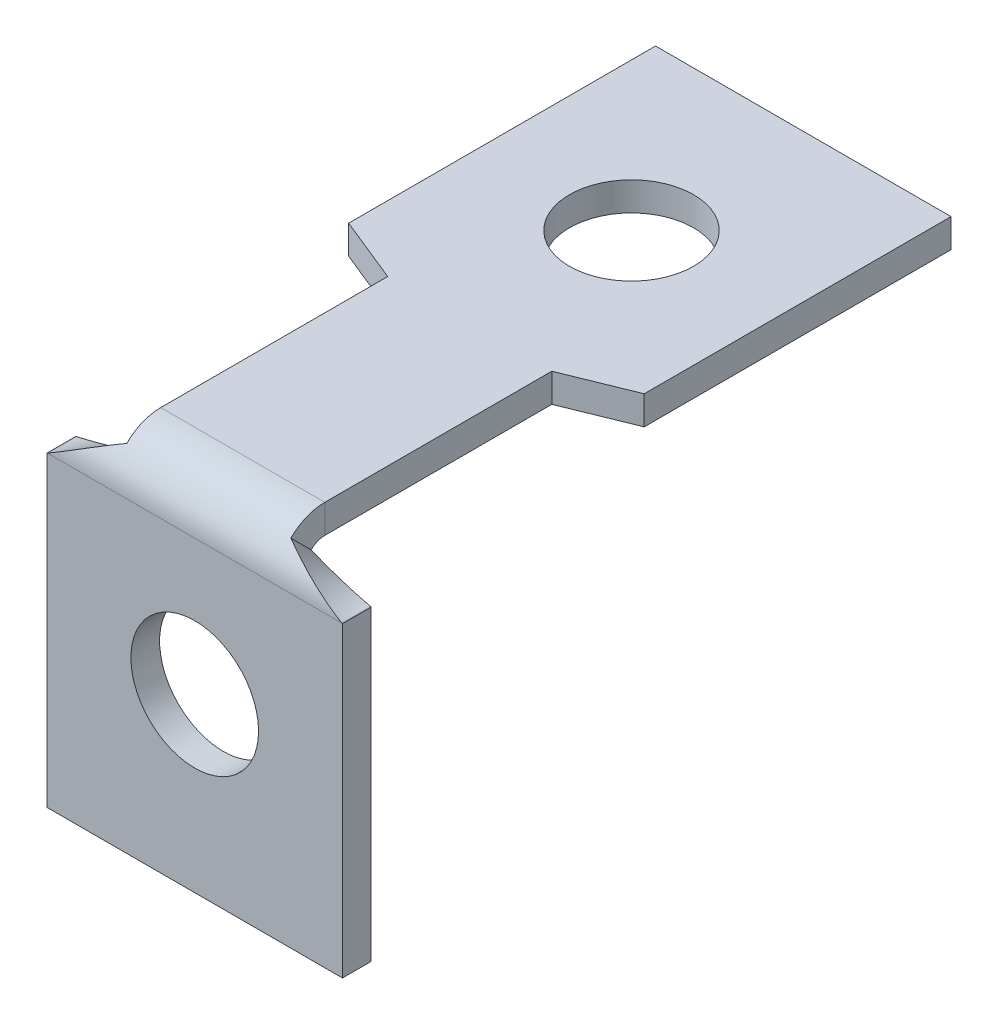
ISO-10303-21;
HEADER;
FILE_DESCRIPTION(('STEP AP214'),'2;1');
FILE_NAME('part.step','',(''),(''),'','','');
FILE_SCHEMA(('AUTOMOTIVE_DESIGN { 1 0 10303 214 1 1 1 1 }'));
ENDSEC;
DATA;
#1=APPLICATION_CONTEXT('core data for automotive mechanical design processes');
#2=APPLICATION_PROTOCOL_DEFINITION('international standard','automotive_design',2000,#1);
#3=PRODUCT_CONTEXT('',#1,'mechanical');
#4=PRODUCT('Part','Part','',(#3));
#5=PRODUCT_RELATED_PRODUCT_CATEGORY('part','',(#4));
#6=PRODUCT_DEFINITION_FORMATION('','',#4);
#7=PRODUCT_DEFINITION_CONTEXT('part definition',#1,'design');
#8=PRODUCT_DEFINITION('design','',#6,#7);
#9=PRODUCT_DEFINITION_SHAPE('','',#8);
#10=(LENGTH_UNIT() NAMED_UNIT(*) SI_UNIT(.MILLI.,.METRE.));
#11=(NAMED_UNIT(*) PLANE_ANGLE_UNIT() SI_UNIT($,.RADIAN.));
#12=(NAMED_UNIT(*) SI_UNIT($,.STERADIAN.) SOLID_ANGLE_UNIT());
#13=UNCERTAINTY_MEASURE_WITH_UNIT(LENGTH_MEASURE(1.E-05),#10,'distance_accuracy_value','');
#14=(GEOMETRIC_REPRESENTATION_CONTEXT(3) GLOBAL_UNCERTAINTY_ASSIGNED_CONTEXT((#13)) GLOBAL_UNIT_ASSIGNED_CONTEXT((#10,
#11,#12)) REPRESENTATION_CONTEXT('',''));
#15=CARTESIAN_POINT('',(0.,0.,0.));
#16=DIRECTION('',(0.,0.,1.));
#17=DIRECTION('',(1.,0.,0.));
#18=AXIS2_PLACEMENT_3D('',#15,#16,#17);
#19=CARTESIAN_POINT('',(0.,6.98086977581013,5.33813022418991));
#20=DIRECTION('',(0.,-1.,0.));
#21=DIRECTION('',(-1.,0.,0.));
#22=AXIS2_PLACEMENT_3D('',#19,#20,#21);
#23=PLANE('',#22);
#24=CARTESIAN_POINT('',(0.,6.98086977581005,-16.6328697758101));
#25=DIRECTION('',(0.,1.,0.));
#26=DIRECTION('',(1.,0.,0.));
#27=AXIS2_PLACEMENT_3D('',#24,#25,#26);
#28=CIRCLE('',#27,2.36295847969978);
#29=CARTESIAN_POINT('',(2.36295847969978,6.98086977581005,-16.6328697758101));
#30=VERTEX_POINT('',#29);
#31=EDGE_CURVE('E288',#30,#30,#28,.T.);
#32=ORIENTED_EDGE('',*,*,#31,.F.);
#33=EDGE_LOOP('',(#32));
#34=FACE_BOUND('',#33,.T.);
#35=DIRECTION('',(0.,0.,1.));
#36=VECTOR('',#35,1.);
#37=CARTESIAN_POINT('',(-3.1242,6.98086977581011,-0.82136977581009));
#38=LINE('',#37,#36);
#39=CARTESIAN_POINT('',(-3.1242,6.98086977581007,-10.4733697758101));
#40=VERTEX_POINT('',#39);
#41=CARTESIAN_POINT('',(-3.1242,6.9808697758101,-1.8288));
#42=VERTEX_POINT('',#41);
#43=EDGE_CURVE('E74',#40,#42,#38,.T.);
#44=ORIENTED_EDGE('',*,*,#43,.T.);
#45=DIRECTION('',(1.,0.,0.));
#46=VECTOR('',#45,1.);
#47=CARTESIAN_POINT('',(0.,6.9808697758101,-1.8288));
#48=LINE('',#47,#46);
#49=CARTESIAN_POINT('',(3.1242,6.9808697758101,-1.8288));
#50=VERTEX_POINT('',#49);
#51=EDGE_CURVE('E66',#42,#50,#48,.T.);
#52=ORIENTED_EDGE('',*,*,#51,.T.);
#53=DIRECTION('',(0.,0.,-1.));
#54=VECTOR('',#53,1.);
#55=CARTESIAN_POINT('',(3.1242,6.98086977581007,-10.4733697758101));
#56=LINE('',#55,#54);
#57=CARTESIAN_POINT('',(3.1242,6.98086977581007,-10.4733697758101));
#58=VERTEX_POINT('',#57);
#59=EDGE_CURVE('E82',#50,#58,#56,.T.);
#60=ORIENTED_EDGE('',*,*,#59,.T.);
#61=DIRECTION('',(0.926517818130893,0.,-0.376250890611529));
#62=VECTOR('',#61,1.);
#63=CARTESIAN_POINT('',(5.6261,6.98086977581007,-11.4893697758101));
#64=LINE('',#63,#62);
#65=CARTESIAN_POINT('',(5.6261,6.98086977581007,-11.4893697758101));
#66=VERTEX_POINT('',#65);
#67=EDGE_CURVE('E320',#58,#66,#64,.T.);
#68=ORIENTED_EDGE('',*,*,#67,.T.);
#69=DIRECTION('',(0.,0.,-1.));
#70=VECTOR('',#69,1.);
#71=CARTESIAN_POINT('',(5.6261,6.98086977581003,-23.1733697758101));
#72=LINE('',#71,#70);
#73=CARTESIAN_POINT('',(5.6261,6.98086977581003,-23.1733697758101));
#74=VERTEX_POINT('',#73);
#75=EDGE_CURVE('E323',#66,#74,#72,.T.);
#76=ORIENTED_EDGE('',*,*,#75,.T.);
#77=DIRECTION('',(-1.,0.,0.));
#78=VECTOR('',#77,1.);
#79=CARTESIAN_POINT('',(-5.6261,6.98086977581003,-23.1733697758101));
#80=LINE('',#79,#78);
#81=CARTESIAN_POINT('',(-5.6261,6.98086977581003,-23.1733697758101));
#82=VERTEX_POINT('',#81);
#83=EDGE_CURVE('E302',#74,#82,#80,.T.);
#84=ORIENTED_EDGE('',*,*,#83,.T.);
#85=DIRECTION('',(0.,0.,1.));
#86=VECTOR('',#85,1.);
#87=CARTESIAN_POINT('',(-5.6261,6.98086977581007,-11.4893697758101));
#88=LINE('',#87,#86);
#89=CARTESIAN_POINT('',(-5.6261,6.98086977581007,-11.4893697758101));
#90=VERTEX_POINT('',#89);
#91=EDGE_CURVE('E293',#82,#90,#88,.T.);
#92=ORIENTED_EDGE('',*,*,#91,.T.);
#93=DIRECTION('',(0.926517818130893,0.,0.376250890611529));
#94=VECTOR('',#93,1.);
#95=CARTESIAN_POINT('',(-3.1242,6.98086977581007,-10.4733697758101));
#96=LINE('',#95,#94);
#97=EDGE_CURVE('E318',#90,#40,#96,.T.);
#98=ORIENTED_EDGE('',*,*,#97,.T.);
#99=EDGE_LOOP('',(#44,#52,#60,#68,#76,#84,#92,#98));
#100=FACE_BOUND('',#99,.T.);
#101=ADVANCED_FACE('F57',(#34,#100),#23,.F.);
#102=CARTESIAN_POINT('',(-5.6261,5.88866977581007,-11.4893697758101));
#103=DIRECTION('',(-1.,0.,0.));
#104=DIRECTION('',(0.,1.,0.));
#105=AXIS2_PLACEMENT_3D('',#102,#103,#104);
#106=PLANE('',#105);
#107=ORIENTED_EDGE('',*,*,#91,.F.);
#108=DIRECTION('',(0.,1.,0.));
#109=VECTOR('',#108,1.);
#110=CARTESIAN_POINT('',(-5.6261,5.88866977581003,-23.1733697758101));
#111=LINE('',#110,#109);
#112=CARTESIAN_POINT('',(-5.6261,5.88866977581003,-23.1733697758101));
#113=VERTEX_POINT('',#112);
#114=EDGE_CURVE('E328',#113,#82,#111,.T.);
#115=ORIENTED_EDGE('',*,*,#114,.F.);
#116=DIRECTION('',(0.,0.,1.));
#117=VECTOR('',#116,1.);
#118=CARTESIAN_POINT('',(-5.6261,5.88866977581007,-11.4893697758101));
#119=LINE('',#118,#117);
#120=CARTESIAN_POINT('',(-5.6261,5.88866977581007,-11.4893697758101));
#121=VERTEX_POINT('',#120);
#122=EDGE_CURVE('E298',#113,#121,#119,.T.);
#123=ORIENTED_EDGE('',*,*,#122,.T.);
#124=DIRECTION('',(0.,1.,0.));
#125=VECTOR('',#124,1.);
#126=CARTESIAN_POINT('',(-5.6261,5.88866977581007,-11.4893697758101));
#127=LINE('',#126,#125);
#128=EDGE_CURVE('E315',#121,#90,#127,.T.);
#129=ORIENTED_EDGE('',*,*,#128,.T.);
#130=EDGE_LOOP('',(#107,#115,#123,#129));
#131=FACE_BOUND('',#130,.T.);
#132=ADVANCED_FACE('F261',(#131),#106,.T.);
#133=CARTESIAN_POINT('',(-5.6261,5.88866977581003,-23.1733697758101));
#134=DIRECTION('',(0.,0.,-1.));
#135=DIRECTION('',(0.,1.,0.));
#136=AXIS2_PLACEMENT_3D('',#133,#134,#135);
#137=PLANE('',#136);
#138=ORIENTED_EDGE('',*,*,#83,.F.);
#139=DIRECTION('',(0.,1.,0.));
#140=VECTOR('',#139,1.);
#141=CARTESIAN_POINT('',(5.6261,5.88866977581003,-23.1733697758101));
#142=LINE('',#141,#140);
#143=CARTESIAN_POINT('',(5.6261,5.88866977581003,-23.1733697758101));
#144=VERTEX_POINT('',#143);
#145=EDGE_CURVE('E331',#144,#74,#142,.T.);
#146=ORIENTED_EDGE('',*,*,#145,.F.);
#147=DIRECTION('',(-1.,0.,0.));
#148=VECTOR('',#147,1.);
#149=CARTESIAN_POINT('',(-5.6261,5.88866977581003,-23.1733697758101));
#150=LINE('',#149,#148);
#151=EDGE_CURVE('E312',#144,#113,#150,.T.);
#152=ORIENTED_EDGE('',*,*,#151,.T.);
#153=ORIENTED_EDGE('',*,*,#114,.T.);
#154=EDGE_LOOP('',(#138,#146,#152,#153));
#155=FACE_BOUND('',#154,.T.);
#156=ADVANCED_FACE('F257',(#155),#137,.T.);
#157=CARTESIAN_POINT('',(5.6261,5.88866977581003,-23.1733697758101));
#158=DIRECTION('',(1.,0.,0.));
#159=DIRECTION('',(0.,0.,-1.));
#160=AXIS2_PLACEMENT_3D('',#157,#158,#159);
#161=PLANE('',#160);
#162=ORIENTED_EDGE('',*,*,#75,.F.);
#163=DIRECTION('',(0.,1.,0.));
#164=VECTOR('',#163,1.);
#165=CARTESIAN_POINT('',(5.6261,5.88866977581007,-11.4893697758101));
#166=LINE('',#165,#164);
#167=CARTESIAN_POINT('',(5.6261,5.88866977581007,-11.4893697758101));
#168=VERTEX_POINT('',#167);
#169=EDGE_CURVE('E333',#168,#66,#166,.T.);
#170=ORIENTED_EDGE('',*,*,#169,.F.);
#171=DIRECTION('',(0.,0.,-1.));
#172=VECTOR('',#171,1.);
#173=CARTESIAN_POINT('',(5.6261,5.88866977581003,-23.1733697758101));
#174=LINE('',#173,#172);
#175=EDGE_CURVE('E309',#168,#144,#174,.T.);
#176=ORIENTED_EDGE('',*,*,#175,.T.);
#177=ORIENTED_EDGE('',*,*,#145,.T.);
#178=EDGE_LOOP('',(#162,#170,#176,#177));
#179=FACE_BOUND('',#178,.T.);
#180=ADVANCED_FACE('F260',(#179),#161,.T.);
#181=CARTESIAN_POINT('',(5.6261,5.88866977581007,-11.4893697758101));
#182=DIRECTION('',(0.376250890611529,0.,0.926517818130893));
#183=DIRECTION('',(0.926517818130893,0.,-0.376250890611529));
#184=AXIS2_PLACEMENT_3D('',#181,#182,#183);
#185=PLANE('',#184);
#186=ORIENTED_EDGE('',*,*,#67,.F.);
#187=DIRECTION('',(0.,1.,0.));
#188=VECTOR('',#187,1.);
#189=CARTESIAN_POINT('',(3.1242,5.88866977581007,-10.4733697758101));
#190=LINE('',#189,#188);
#191=CARTESIAN_POINT('',(3.1242,5.88866977581007,-10.4733697758101));
#192=VERTEX_POINT('',#191);
#193=EDGE_CURVE('E335',#192,#58,#190,.T.);
#194=ORIENTED_EDGE('',*,*,#193,.F.);
#195=DIRECTION('',(0.926517818130893,0.,-0.376250890611529));
#196=VECTOR('',#195,1.);
#197=CARTESIAN_POINT('',(5.6261,5.88866977581007,-11.4893697758101));
#198=LINE('',#197,#196);
#199=EDGE_CURVE('E306',#192,#168,#198,.T.);
#200=ORIENTED_EDGE('',*,*,#199,.T.);
#201=ORIENTED_EDGE('',*,*,#169,.T.);
#202=EDGE_LOOP('',(#186,#194,#200,#201));
#203=FACE_BOUND('',#202,.T.);
#204=ADVANCED_FACE('F265',(#203),#185,.T.);
#205=CARTESIAN_POINT('',(3.1242,5.88866977581007,-10.4733697758101));
#206=DIRECTION('',(1.,0.,0.));
#207=DIRECTION('',(0.,-1.,0.));
#208=AXIS2_PLACEMENT_3D('',#205,#206,#207);
#209=PLANE('',#208);
#210=DIRECTION('',(0.,1.,0.));
#211=VECTOR('',#210,1.);
#212=CARTESIAN_POINT('',(3.1242,5.88866977581004,-1.8288));
#213=LINE('',#212,#211);
#214=CARTESIAN_POINT('',(3.1242,5.8886697758101,-1.82880000000001));
#215=VERTEX_POINT('',#214);
#216=EDGE_CURVE('E341',#215,#50,#213,.T.);
#217=ORIENTED_EDGE('',*,*,#216,.F.);
#218=DIRECTION('',(0.,0.,-1.));
#219=VECTOR('',#218,1.);
#220=CARTESIAN_POINT('',(3.1242,5.88866977581007,-10.4733697758101));
#221=LINE('',#220,#219);
#222=EDGE_CURVE('E61',#215,#192,#221,.T.);
#223=ORIENTED_EDGE('',*,*,#222,.T.);
#224=ORIENTED_EDGE('',*,*,#193,.T.);
#225=ORIENTED_EDGE('',*,*,#59,.F.);
#226=EDGE_LOOP('',(#217,#223,#224,#225));
#227=FACE_BOUND('',#226,.T.);
#228=ADVANCED_FACE('F269',(#227),#209,.T.);
#229=CARTESIAN_POINT('',(-3.1242,5.88866977581011,-0.821369775810086));
#230=DIRECTION('',(-1.,0.,0.));
#231=DIRECTION('',(0.,1.,0.));
#232=AXIS2_PLACEMENT_3D('',#229,#230,#231);
#233=PLANE('',#232);
#234=DIRECTION('',(0.,-1.,0.));
#235=VECTOR('',#234,1.);
#236=CARTESIAN_POINT('',(-3.1242,5.88866977581011,-1.8288));
#237=LINE('',#236,#235);
#238=CARTESIAN_POINT('',(-3.1242,5.8886697758101,-1.8288));
#239=VERTEX_POINT('',#238);
#240=EDGE_CURVE('E12',#42,#239,#237,.T.);
#241=ORIENTED_EDGE('',*,*,#240,.F.);
#242=ORIENTED_EDGE('',*,*,#43,.F.);
#243=DIRECTION('',(0.,1.,0.));
#244=VECTOR('',#243,1.);
#245=CARTESIAN_POINT('',(-3.1242,5.88866977581007,-10.4733697758101));
#246=LINE('',#245,#244);
#247=CARTESIAN_POINT('',(-3.1242,5.88866977581007,-10.4733697758101));
#248=VERTEX_POINT('',#247);
#249=EDGE_CURVE('E337',#248,#40,#246,.T.);
#250=ORIENTED_EDGE('',*,*,#249,.F.);
#251=DIRECTION('',(0.,0.,1.));
#252=VECTOR('',#251,1.);
#253=CARTESIAN_POINT('',(-3.1242,5.88866977581011,-0.821369775810086));
#254=LINE('',#253,#252);
#255=EDGE_CURVE('E305',#248,#239,#254,.T.);
#256=ORIENTED_EDGE('',*,*,#255,.T.);
#257=EDGE_LOOP('',(#241,#242,#250,#256));
#258=FACE_BOUND('',#257,.T.);
#259=ADVANCED_FACE('F59',(#258),#233,.T.);
#260=CARTESIAN_POINT('',(-3.1242,5.88866977581007,-10.4733697758101));
#261=DIRECTION('',(-0.376250890611529,0.,0.926517818130893));
#262=DIRECTION('',(0.926517818130893,0.,0.376250890611529));
#263=AXIS2_PLACEMENT_3D('',#260,#261,#262);
#264=PLANE('',#263);
#265=ORIENTED_EDGE('',*,*,#97,.F.);
#266=ORIENTED_EDGE('',*,*,#128,.F.);
#267=DIRECTION('',(0.926517818130893,0.,0.376250890611529));
#268=VECTOR('',#267,1.);
#269=CARTESIAN_POINT('',(-3.1242,5.88866977581007,-10.4733697758101));
#270=LINE('',#269,#268);
#271=EDGE_CURVE('E301',#121,#248,#270,.T.);
#272=ORIENTED_EDGE('',*,*,#271,.T.);
#273=ORIENTED_EDGE('',*,*,#249,.T.);
#274=EDGE_LOOP('',(#265,#266,#272,#273));
#275=FACE_BOUND('',#274,.T.);
#276=ADVANCED_FACE('F271',(#275),#264,.T.);
#277=CARTESIAN_POINT('',(0.,5.88866977581013,5.33813022418992));
#278=DIRECTION('',(0.,-1.,0.));
#279=DIRECTION('',(-1.,0.,0.));
#280=AXIS2_PLACEMENT_3D('',#277,#278,#279);
#281=PLANE('',#280);
#282=DIRECTION('',(1.,0.,0.));
#283=VECTOR('',#282,1.);
#284=CARTESIAN_POINT('',(0.,5.8886697758101,-1.8288));
#285=LINE('',#284,#283);
#286=EDGE_CURVE('E330',#239,#215,#285,.T.);
#287=ORIENTED_EDGE('',*,*,#286,.F.);
#288=ORIENTED_EDGE('',*,*,#255,.F.);
#289=ORIENTED_EDGE('',*,*,#271,.F.);
#290=ORIENTED_EDGE('',*,*,#122,.F.);
#291=ORIENTED_EDGE('',*,*,#151,.F.);
#292=ORIENTED_EDGE('',*,*,#175,.F.);
#293=ORIENTED_EDGE('',*,*,#199,.F.);
#294=ORIENTED_EDGE('',*,*,#222,.F.);
#295=EDGE_LOOP('',(#287,#288,#289,#290,#291,#292,#293,#294));
#296=FACE_BOUND('',#295,.T.);
#297=CARTESIAN_POINT('',(0.,5.88866977581005,-16.6328697758101));
#298=DIRECTION('',(0.,1.,0.));
#299=DIRECTION('',(1.,0.,0.));
#300=AXIS2_PLACEMENT_3D('',#297,#298,#299);
#301=CIRCLE('',#300,2.36295847969978);
#302=CARTESIAN_POINT('',(2.36295847969978,5.88866977581005,-16.6328697758101));
#303=VERTEX_POINT('',#302);
#304=EDGE_CURVE('E290',#303,#303,#301,.T.);
#305=ORIENTED_EDGE('',*,*,#304,.T.);
#306=EDGE_LOOP('',(#305));
#307=FACE_BOUND('',#306,.T.);
#308=ADVANCED_FACE('F255',(#296,#307),#281,.T.);
#309=CARTESIAN_POINT('',(0.,5.88866977581005,-16.6328697758101));
#310=DIRECTION('',(0.,1.,0.));
#311=DIRECTION('',(1.,0.,0.));
#312=AXIS2_PLACEMENT_3D('',#309,#310,#311);
#313=CYLINDRICAL_SURFACE('',#312,2.36295847969978);
#314=ORIENTED_EDGE('',*,*,#304,.F.);
#315=EDGE_LOOP('',(#314));
#316=FACE_BOUND('',#315,.T.);
#317=ORIENTED_EDGE('',*,*,#31,.T.);
#318=EDGE_LOOP('',(#317));
#319=FACE_BOUND('',#318,.T.);
#320=ADVANCED_FACE('F251',(#316,#319),#313,.F.);
#321=CARTESIAN_POINT('',(-5.6261,-6.5405,-1.0922));
#322=DIRECTION('',(-1.,0.,0.));
#323=DIRECTION('',(0.,0.,1.));
#324=AXIS2_PLACEMENT_3D('',#321,#322,#323);
#325=PLANE('',#324);
#326=DIRECTION('',(0.,-1.,0.));
#327=VECTOR('',#326,1.);
#328=CARTESIAN_POINT('',(-5.6261,-6.5405,0.));
#329=LINE('',#328,#327);
#330=CARTESIAN_POINT('',(-5.6261,5.1435,0.));
#331=VERTEX_POINT('',#330);
#332=CARTESIAN_POINT('',(-5.6261,-6.5405,0.));
#333=VERTEX_POINT('',#332);
#334=EDGE_CURVE('E480',#331,#333,#329,.T.);
#335=ORIENTED_EDGE('',*,*,#334,.F.);
#336=DIRECTION('',(0.,0.,1.));
#337=VECTOR('',#336,1.);
#338=CARTESIAN_POINT('',(-5.6261,5.1435,-1.0922));
#339=LINE('',#338,#337);
#340=CARTESIAN_POINT('',(-5.6261,5.1435,-1.0922));
#341=VERTEX_POINT('',#340);
#342=EDGE_CURVE('E226',#341,#331,#339,.T.);
#343=ORIENTED_EDGE('',*,*,#342,.F.);
#344=DIRECTION('',(0.,-1.,0.));
#345=VECTOR('',#344,1.);
#346=CARTESIAN_POINT('',(-5.6261,-6.5405,-1.0922));
#347=LINE('',#346,#345);
#348=CARTESIAN_POINT('',(-5.6261,-6.5405,-1.0922));
#349=VERTEX_POINT('',#348);
#350=EDGE_CURVE('E483',#341,#349,#347,.T.);
#351=ORIENTED_EDGE('',*,*,#350,.T.);
#352=DIRECTION('',(0.,0.,1.));
#353=VECTOR('',#352,1.);
#354=CARTESIAN_POINT('',(-5.6261,-6.5405,-1.0922));
#355=LINE('',#354,#353);
#356=EDGE_CURVE('E486',#349,#333,#355,.T.);
#357=ORIENTED_EDGE('',*,*,#356,.T.);
#358=EDGE_LOOP('',(#335,#343,#351,#357));
#359=FACE_BOUND('',#358,.T.);
#360=ADVANCED_FACE('F254',(#359),#325,.T.);
#361=CARTESIAN_POINT('',(5.6261,-6.5405,-1.0922));
#362=DIRECTION('',(0.,-1.,0.));
#363=DIRECTION('',(0.,0.,-1.));
#364=AXIS2_PLACEMENT_3D('',#361,#362,#363);
#365=PLANE('',#364);
#366=DIRECTION('',(1.,0.,0.));
#367=VECTOR('',#366,1.);
#368=CARTESIAN_POINT('',(5.6261,-6.5405,0.));
#369=LINE('',#368,#367);
#370=CARTESIAN_POINT('',(5.6261,-6.5405,0.));
#371=VERTEX_POINT('',#370);
#372=EDGE_CURVE('E526',#333,#371,#369,.T.);
#373=ORIENTED_EDGE('',*,*,#372,.F.);
#374=ORIENTED_EDGE('',*,*,#356,.F.);
#375=DIRECTION('',(1.,0.,0.));
#376=VECTOR('',#375,1.);
#377=CARTESIAN_POINT('',(5.6261,-6.5405,-1.0922));
#378=LINE('',#377,#376);
#379=CARTESIAN_POINT('',(5.6261,-6.5405,-1.0922));
#380=VERTEX_POINT('',#379);
#381=EDGE_CURVE('E541',#349,#380,#378,.T.);
#382=ORIENTED_EDGE('',*,*,#381,.T.);
#383=DIRECTION('',(0.,0.,1.));
#384=VECTOR('',#383,1.);
#385=CARTESIAN_POINT('',(5.6261,-6.5405,-1.0922));
#386=LINE('',#385,#384);
#387=EDGE_CURVE('E539',#380,#371,#386,.T.);
#388=ORIENTED_EDGE('',*,*,#387,.T.);
#389=EDGE_LOOP('',(#373,#374,#382,#388));
#390=FACE_BOUND('',#389,.T.);
#391=ADVANCED_FACE('F516',(#390),#365,.T.);
#392=CARTESIAN_POINT('',(5.6261,5.1435,-1.0922));
#393=DIRECTION('',(1.,0.,0.));
#394=DIRECTION('',(0.,1.,0.));
#395=AXIS2_PLACEMENT_3D('',#392,#393,#394);
#396=PLANE('',#395);
#397=DIRECTION('',(0.,1.,0.));
#398=VECTOR('',#397,1.);
#399=CARTESIAN_POINT('',(5.6261,5.1435,0.));
#400=LINE('',#399,#398);
#401=CARTESIAN_POINT('',(5.6261,5.1435,0.));
#402=VERTEX_POINT('',#401);
#403=EDGE_CURVE('E493',#371,#402,#400,.T.);
#404=ORIENTED_EDGE('',*,*,#403,.F.);
#405=ORIENTED_EDGE('',*,*,#387,.F.);
#406=DIRECTION('',(0.,1.,0.));
#407=VECTOR('',#406,1.);
#408=CARTESIAN_POINT('',(5.6261,5.1435,-1.0922));
#409=LINE('',#408,#407);
#410=CARTESIAN_POINT('',(5.6261,5.1435,-1.0922));
#411=VERTEX_POINT('',#410);
#412=EDGE_CURVE('E537',#380,#411,#409,.T.);
#413=ORIENTED_EDGE('',*,*,#412,.T.);
#414=DIRECTION('',(0.,0.,1.));
#415=VECTOR('',#414,1.);
#416=CARTESIAN_POINT('',(5.6261,5.1435,-1.0922));
#417=LINE('',#416,#415);
#418=EDGE_CURVE('E218',#411,#402,#417,.T.);
#419=ORIENTED_EDGE('',*,*,#418,.T.);
#420=EDGE_LOOP('',(#404,#405,#413,#419));
#421=FACE_BOUND('',#420,.T.);
#422=ADVANCED_FACE('F512',(#421),#396,.T.);
#423=CARTESIAN_POINT('',(0.,0.,-1.0922));
#424=DIRECTION('',(0.,0.,1.));
#425=DIRECTION('',(1.,0.,0.));
#426=AXIS2_PLACEMENT_3D('',#423,#424,#425);
#427=CYLINDRICAL_SURFACE('',#426,2.43087073521856);
#428=CARTESIAN_POINT('',(0.,0.,-1.0922));
#429=DIRECTION('',(0.,0.,1.));
#430=DIRECTION('',(1.,0.,0.));
#431=AXIS2_PLACEMENT_3D('',#428,#429,#430);
#432=CIRCLE('',#431,2.43087073521856);
#433=CARTESIAN_POINT('',(2.43087073521856,0.,-1.0922));
#434=VERTEX_POINT('',#433);
#435=EDGE_CURVE('E215',#434,#434,#432,.T.);
#436=ORIENTED_EDGE('',*,*,#435,.F.);
#437=EDGE_LOOP('',(#436));
#438=FACE_BOUND('',#437,.T.);
#439=CARTESIAN_POINT('',(0.,0.,0.));
#440=DIRECTION('',(0.,0.,1.));
#441=DIRECTION('',(1.,0.,0.));
#442=AXIS2_PLACEMENT_3D('',#439,#440,#441);
#443=CIRCLE('',#442,2.43087073521856);
#444=CARTESIAN_POINT('',(2.43087073521856,0.,0.));
#445=VERTEX_POINT('',#444);
#446=EDGE_CURVE('E533',#445,#445,#443,.T.);
#447=ORIENTED_EDGE('',*,*,#446,.T.);
#448=EDGE_LOOP('',(#447));
#449=FACE_BOUND('',#448,.T.);
#450=ADVANCED_FACE('F508',(#438,#449),#427,.F.);
#451=CARTESIAN_POINT('',(0.,0.,-1.0922));
#452=DIRECTION('',(0.,0.,-1.));
#453=DIRECTION('',(-1.,0.,0.));
#454=AXIS2_PLACEMENT_3D('',#451,#452,#453);
#455=PLANE('',#454);
#456=ORIENTED_EDGE('',*,*,#435,.T.);
#457=EDGE_LOOP('',(#456));
#458=FACE_BOUND('',#457,.T.);
#459=DIRECTION('',(-0.926517818130893,-0.376250890611529,0.));
#460=VECTOR('',#459,1.);
#461=CARTESIAN_POINT('',(-5.6261,5.1435,-1.0922));
#462=LINE('',#461,#460);
#463=CARTESIAN_POINT('',(-5.60499692706764,5.1520697758101,-1.0922));
#464=VERTEX_POINT('',#463);
#465=EDGE_CURVE('E213',#464,#341,#462,.T.);
#466=ORIENTED_EDGE('',*,*,#465,.F.);
#467=DIRECTION('',(1.,0.,0.));
#468=VECTOR('',#467,1.);
#469=CARTESIAN_POINT('',(0.,5.1520697758101,-1.0922));
#470=LINE('',#469,#468);
#471=CARTESIAN_POINT('',(5.60499692706765,5.1520697758101,-1.0922));
#472=VERTEX_POINT('',#471);
#473=EDGE_CURVE('E197',#464,#472,#470,.T.);
#474=ORIENTED_EDGE('',*,*,#473,.T.);
#475=DIRECTION('',(-0.926517818130894,0.376250890611529,0.));
#476=VECTOR('',#475,1.);
#477=CARTESIAN_POINT('',(3.1242,6.1595,-1.0922));
#478=LINE('',#477,#476);
#479=EDGE_CURVE('E188',#411,#472,#478,.T.);
#480=ORIENTED_EDGE('',*,*,#479,.F.);
#481=ORIENTED_EDGE('',*,*,#412,.F.);
#482=ORIENTED_EDGE('',*,*,#381,.F.);
#483=ORIENTED_EDGE('',*,*,#350,.F.);
#484=EDGE_LOOP('',(#466,#474,#480,#481,#482,#483));
#485=FACE_BOUND('',#484,.T.);
#486=ADVANCED_FACE('F209',(#458,#485),#455,.T.);
#487=CARTESIAN_POINT('',(3.1242,6.1595,-1.0922));
#488=DIRECTION('',(0.376250890611529,0.926517818130894,0.));
#489=DIRECTION('',(-0.926517818130894,0.376250890611529,0.));
#490=AXIS2_PLACEMENT_3D('',#487,#488,#489);
#491=PLANE('',#490);
#492=ORIENTED_EDGE('',*,*,#479,.T.);
#493=CARTESIAN_POINT('',(5.60499692706765,5.15206977581009,0.));
#494=CARTESIAN_POINT('',(5.60499692706765,5.1520697758101,-1.0922));
#495=B_SPLINE_CURVE_WITH_KNOTS('',1,(#493,#494),.UNSPECIFIED.,.F.,.F.,(2,2),(0.,1.),.UNSPECIFIED.);
#496=CARTESIAN_POINT('',(5.60499692706766,5.15206977581009,0.));
#497=VERTEX_POINT('',#496);
#498=EDGE_CURVE('E173',#472,#497,#495,.F.);
#499=ORIENTED_EDGE('',*,*,#498,.T.);
#500=DIRECTION('',(-0.926517818130894,0.376250890611529,0.));
#501=VECTOR('',#500,1.);
#502=CARTESIAN_POINT('',(3.1242,6.1595,0.));
#503=LINE('',#502,#501);
#504=EDGE_CURVE('E470',#402,#497,#503,.T.);
#505=ORIENTED_EDGE('',*,*,#504,.F.);
#506=ORIENTED_EDGE('',*,*,#418,.F.);
#507=EDGE_LOOP('',(#492,#499,#505,#506));
#508=FACE_BOUND('',#507,.T.);
#509=ADVANCED_FACE('F217',(#508),#491,.T.);
#510=CARTESIAN_POINT('',(0.,0.,0.));
#511=DIRECTION('',(0.,0.,-1.));
#512=DIRECTION('',(-1.,0.,0.));
#513=AXIS2_PLACEMENT_3D('',#510,#511,#512);
#514=PLANE('',#513);
#515=DIRECTION('',(1.,0.,0.));
#516=VECTOR('',#515,1.);
#517=CARTESIAN_POINT('',(0.,5.15206977581009,0.));
#518=LINE('',#517,#516);
#519=CARTESIAN_POINT('',(-5.60499692706764,5.15206977581009,0.));
#520=VERTEX_POINT('',#519);
#521=EDGE_CURVE('E473',#520,#497,#518,.T.);
#522=ORIENTED_EDGE('',*,*,#521,.F.);
#523=DIRECTION('',(-0.926517818130893,-0.376250890611529,0.));
#524=VECTOR('',#523,1.);
#525=CARTESIAN_POINT('',(-5.6261,5.1435,0.));
#526=LINE('',#525,#524);
#527=EDGE_CURVE('E187',#520,#331,#526,.T.);
#528=ORIENTED_EDGE('',*,*,#527,.T.);
#529=ORIENTED_EDGE('',*,*,#334,.T.);
#530=ORIENTED_EDGE('',*,*,#372,.T.);
#531=ORIENTED_EDGE('',*,*,#403,.T.);
#532=ORIENTED_EDGE('',*,*,#504,.T.);
#533=EDGE_LOOP('',(#522,#528,#529,#530,#531,#532));
#534=FACE_BOUND('',#533,.T.);
#535=ORIENTED_EDGE('',*,*,#446,.F.);
#536=EDGE_LOOP('',(#535));
#537=FACE_BOUND('',#536,.T.);
#538=ADVANCED_FACE('F249',(#534,#537),#514,.F.);
#539=CARTESIAN_POINT('',(-5.6261,5.1435,-1.0922));
#540=DIRECTION('',(-0.376250890611529,0.926517818130893,0.));
#541=DIRECTION('',(-0.926517818130893,-0.376250890611529,0.));
#542=AXIS2_PLACEMENT_3D('',#539,#540,#541);
#543=PLANE('',#542);
#544=ORIENTED_EDGE('',*,*,#527,.F.);
#545=CARTESIAN_POINT('',(-5.60499692706764,5.1520697758101,-1.0922));
#546=CARTESIAN_POINT('',(-5.60499692706764,5.15206977581009,0.));
#547=B_SPLINE_CURVE_WITH_KNOTS('',1,(#545,#546),.UNSPECIFIED.,.F.,.F.,(2,2),(0.,1.),.UNSPECIFIED.);
#548=EDGE_CURVE('E227',#520,#464,#547,.F.);
#549=ORIENTED_EDGE('',*,*,#548,.T.);
#550=ORIENTED_EDGE('',*,*,#465,.T.);
#551=ORIENTED_EDGE('',*,*,#342,.T.);
#552=EDGE_LOOP('',(#544,#549,#550,#551));
#553=FACE_BOUND('',#552,.T.);
#554=ADVANCED_FACE('F238',(#553),#543,.T.);
#555=CARTESIAN_POINT('',(-5.60499692706764,5.15206977581009,0.));
#556=CARTESIAN_POINT('',(-5.19151205685517,5.39146997206318,0.));
#557=CARTESIAN_POINT('',(-4.7780646180451,5.63075430672634,-0.0475987689089816));
#558=CARTESIAN_POINT('',(-3.95113230902255,6.07308816711239,-0.230819452977728));
#559=CARTESIAN_POINT('',(-3.53768487021247,6.2759451550561,-0.366361616378086));
#560=CARTESIAN_POINT('',(-3.1242,6.44522665724405,-0.535643118566035));
#561=CARTESIAN_POINT('',(-5.60499692706764,5.1520697758101,-1.0922));
#562=CARTESIAN_POINT('',(-5.19152692759817,5.24849138698456,-1.0922));
#563=CARTESIAN_POINT('',(-4.7780646180451,5.34487326742914,-1.11137172636612));
#564=CARTESIAN_POINT('',(-3.95113230902255,5.5230355167513,-1.18516894633825));
#565=CARTESIAN_POINT('',(-3.53766999946947,5.60474425571771,-1.23976476986359));
#566=CARTESIAN_POINT('',(-3.1242,5.67292463083211,-1.30794514497799));
#567=B_SPLINE_SURFACE_WITH_KNOTS('',1,3,((#555,#556,#557,#558,#559,#560),(#561,#562,#563,#564,
#565,#566)),.UNSPECIFIED.,.F.,.F.,.F.,(2,2),(4,2,4),(0.,1.),(0.,0.5,1.),.UNSPECIFIED.);
#568=CARTESIAN_POINT('',(-5.60499692706764,5.15206977581009,0.));
#569=CARTESIAN_POINT('',(-5.19151205685517,5.39146997206318,0.));
#570=CARTESIAN_POINT('',(-4.7780646180451,5.63075430672634,-0.0475987689089816));
#571=CARTESIAN_POINT('',(-3.95113230902255,6.07308816711239,-0.230819452977728));
#572=CARTESIAN_POINT('',(-3.53768487021247,6.2759451550561,-0.366361616378086));
#573=CARTESIAN_POINT('',(-3.1242,6.44522665724405,-0.535643118566035));
#574=B_SPLINE_CURVE_WITH_KNOTS('',3,(#568,#569,#570,#571,#572,#573),.UNSPECIFIED.,.F.,.F.,(4,2,
4),(0.,0.5,1.),.UNSPECIFIED.);
#575=CARTESIAN_POINT('',(-3.1242,6.44522665724405,-0.535643118566035));
#576=VERTEX_POINT('',#575);
#577=EDGE_CURVE('E378',#520,#576,#574,.T.);
#578=CARTESIAN_POINT('',(-3.1242,6.44522665724405,-0.535643118566035));
#579=CARTESIAN_POINT('',(-3.1242,5.67292463083211,-1.30794514497799));
#580=B_SPLINE_CURVE_WITH_KNOTS('',1,(#578,#579),.UNSPECIFIED.,.F.,.F.,(2,2),(0.,1.),.UNSPECIFIED.);
#581=CARTESIAN_POINT('',(-3.1242,5.67292463083211,-1.30794514497799));
#582=VERTEX_POINT('',#581);
#583=EDGE_CURVE('E376',#576,#582,#580,.T.);
#584=CARTESIAN_POINT('',(-3.1242,5.67292463083211,-1.30794514497799));
#585=CARTESIAN_POINT('',(-3.53766999946947,5.60474425571771,-1.23976476986359));
#586=CARTESIAN_POINT('',(-3.95113230902255,5.5230355167513,-1.18516894633825));
#587=CARTESIAN_POINT('',(-4.7780646180451,5.34487326742914,-1.11137172636612));
#588=CARTESIAN_POINT('',(-5.19152692759817,5.24849138698456,-1.0922));
#589=CARTESIAN_POINT('',(-5.60499692706764,5.1520697758101,-1.0922));
#590=B_SPLINE_CURVE_WITH_KNOTS('',3,(#584,#585,#586,#587,#588,#589),.UNSPECIFIED.,.F.,.F.,(4,2,
4),(0.,0.5,1.),.UNSPECIFIED.);
#591=EDGE_CURVE('E469',#464,#582,#590,.F.);
#592=ORIENTED_EDGE('',*,*,#548,.F.);
#593=ORIENTED_EDGE('',*,*,#577,.T.);
#594=ORIENTED_EDGE('',*,*,#583,.T.);
#595=ORIENTED_EDGE('',*,*,#591,.F.);
#596=EDGE_LOOP('',(#592,#593,#594,#595));
#597=FACE_BOUND('',#596,.T.);
#598=ADVANCED_FACE('F248',(#597),#567,.F.);
#599=CARTESIAN_POINT('',(-3.1242,5.1520697758101,-1.8288));
#600=DIRECTION('',(1.,0.,0.));
#601=DIRECTION('',(0.,0.,-1.));
#602=AXIS2_PLACEMENT_3D('',#599,#600,#601);
#603=PLANE('',#602);
#604=ORIENTED_EDGE('',*,*,#583,.F.);
#605=CARTESIAN_POINT('',(-3.1242,5.1520697758101,-1.8288));
#606=DIRECTION('',(1.,0.,0.));
#607=DIRECTION('',(0.,1.,0.));
#608=AXIS2_PLACEMENT_3D('',#605,#606,#607);
#609=CIRCLE('',#608,1.8288);
#610=EDGE_CURVE('E371',#576,#42,#609,.F.);
#611=ORIENTED_EDGE('',*,*,#610,.T.);
#612=ORIENTED_EDGE('',*,*,#240,.T.);
#613=CARTESIAN_POINT('',(-3.1242,5.1520697758101,-1.8288));
#614=DIRECTION('',(-1.,0.,0.));
#615=DIRECTION('',(0.,0.,-1.));
#616=AXIS2_PLACEMENT_3D('',#613,#614,#615);
#617=CIRCLE('',#616,0.7366);
#618=EDGE_CURVE('E388',#582,#239,#617,.T.);
#619=ORIENTED_EDGE('',*,*,#618,.F.);
#620=EDGE_LOOP('',(#604,#611,#612,#619));
#621=FACE_BOUND('',#620,.T.);
#622=ADVANCED_FACE('F375',(#621),#603,.F.);
#623=CARTESIAN_POINT('',(3.1242,5.1520697758101,-1.8288));
#624=DIRECTION('',(-1.,0.,0.));
#625=DIRECTION('',(0.,0.,1.));
#626=AXIS2_PLACEMENT_3D('',#623,#624,#625);
#627=PLANE('',#626);
#628=ORIENTED_EDGE('',*,*,#216,.T.);
#629=CARTESIAN_POINT('',(3.1242,5.1520697758101,-1.8288));
#630=DIRECTION('',(1.,0.,0.));
#631=DIRECTION('',(0.,1.,0.));
#632=AXIS2_PLACEMENT_3D('',#629,#630,#631);
#633=CIRCLE('',#632,1.8288);
#634=CARTESIAN_POINT('',(3.1242,6.44522665724405,-0.535643118566035));
#635=VERTEX_POINT('',#634);
#636=EDGE_CURVE('E374',#50,#635,#633,.T.);
#637=ORIENTED_EDGE('',*,*,#636,.T.);
#638=CARTESIAN_POINT('',(3.1242,5.67292463083211,-1.30794514497799));
#639=CARTESIAN_POINT('',(3.1242,6.44522665724405,-0.535643118566036));
#640=B_SPLINE_CURVE_WITH_KNOTS('',1,(#638,#639),.UNSPECIFIED.,.F.,.F.,(2,2),(0.,1.),.UNSPECIFIED.);
#641=CARTESIAN_POINT('',(3.1242,5.67292463083211,-1.30794514497799));
#642=VERTEX_POINT('',#641);
#643=EDGE_CURVE('E203',#635,#642,#640,.F.);
#644=ORIENTED_EDGE('',*,*,#643,.T.);
#645=CARTESIAN_POINT('',(3.1242,5.1520697758101,-1.8288));
#646=DIRECTION('',(1.,0.,0.));
#647=DIRECTION('',(0.,0.,1.));
#648=AXIS2_PLACEMENT_3D('',#645,#646,#647);
#649=CIRCLE('',#648,0.7366);
#650=EDGE_CURVE('E201',#215,#642,#649,.T.);
#651=ORIENTED_EDGE('',*,*,#650,.F.);
#652=EDGE_LOOP('',(#628,#637,#644,#651));
#653=FACE_BOUND('',#652,.T.);
#654=ADVANCED_FACE('F558',(#653),#627,.F.);
#655=CARTESIAN_POINT('',(3.1242,6.44522665724405,-0.535643118566036));
#656=CARTESIAN_POINT('',(3.53768487021248,6.2759451550561,-0.366361616378086));
#657=CARTESIAN_POINT('',(3.95113230902255,6.07308816711239,-0.230819452977729));
#658=CARTESIAN_POINT('',(4.7780646180451,5.63075430672634,-0.0475987689089818));
#659=CARTESIAN_POINT('',(5.19151205685517,5.39146997206318,0.));
#660=CARTESIAN_POINT('',(5.60499692706765,5.15206977581009,0.));
#661=CARTESIAN_POINT('',(3.1242,5.67292463083211,-1.30794514497799));
#662=CARTESIAN_POINT('',(3.53766999946947,5.60474425571771,-1.23976476986359));
#663=CARTESIAN_POINT('',(3.95113230902255,5.5230355167513,-1.18516894633825));
#664=CARTESIAN_POINT('',(4.7780646180451,5.34487326742914,-1.11137172636612));
#665=CARTESIAN_POINT('',(5.19152692759818,5.24849138698456,-1.0922));
#666=CARTESIAN_POINT('',(5.60499692706765,5.1520697758101,-1.0922));
#667=B_SPLINE_SURFACE_WITH_KNOTS('',1,3,((#655,#656,#657,#658,#659,#660),(#661,#662,#663,#664,
#665,#666)),.UNSPECIFIED.,.F.,.F.,.F.,(2,2),(4,2,4),(0.,1.),(0.,0.5,1.),.UNSPECIFIED.);
#668=CARTESIAN_POINT('',(3.1242,6.44522665724405,-0.535643118566036));
#669=CARTESIAN_POINT('',(3.53768487021248,6.2759451550561,-0.366361616378086));
#670=CARTESIAN_POINT('',(3.95113230902255,6.07308816711239,-0.230819452977729));
#671=CARTESIAN_POINT('',(4.7780646180451,5.63075430672634,-0.0475987689089818));
#672=CARTESIAN_POINT('',(5.19151205685517,5.39146997206318,0.));
#673=CARTESIAN_POINT('',(5.60499692706765,5.15206977581009,0.));
#674=B_SPLINE_CURVE_WITH_KNOTS('',3,(#668,#669,#670,#671,#672,#673),.UNSPECIFIED.,.F.,.F.,(4,2,
4),(0.,0.5,1.),.UNSPECIFIED.);
#675=EDGE_CURVE('E180',#635,#497,#674,.T.);
#676=CARTESIAN_POINT('',(5.60499692706765,5.1520697758101,-1.0922));
#677=CARTESIAN_POINT('',(5.19152692759818,5.24849138698456,-1.0922));
#678=CARTESIAN_POINT('',(4.7780646180451,5.34487326742914,-1.11137172636612));
#679=CARTESIAN_POINT('',(3.95113230902255,5.5230355167513,-1.18516894633825));
#680=CARTESIAN_POINT('',(3.53766999946947,5.60474425571771,-1.23976476986359));
#681=CARTESIAN_POINT('',(3.1242,5.67292463083211,-1.30794514497799));
#682=B_SPLINE_CURVE_WITH_KNOTS('',3,(#676,#677,#678,#679,#680,#681),.UNSPECIFIED.,.F.,.F.,(4,2,
4),(0.,0.5,1.),.UNSPECIFIED.);
#683=EDGE_CURVE('E177',#642,#472,#682,.F.);
#684=ORIENTED_EDGE('',*,*,#675,.T.);
#685=ORIENTED_EDGE('',*,*,#498,.F.);
#686=ORIENTED_EDGE('',*,*,#683,.F.);
#687=ORIENTED_EDGE('',*,*,#643,.F.);
#688=EDGE_LOOP('',(#684,#685,#686,#687));
#689=FACE_BOUND('',#688,.T.);
#690=ADVANCED_FACE('F176',(#689),#667,.F.);
#691=CARTESIAN_POINT('',(-11.4418759683977,5.1520697758101,-1.8288));
#692=DIRECTION('',(1.,0.,0.));
#693=DIRECTION('',(0.,1.,0.));
#694=AXIS2_PLACEMENT_3D('',#691,#692,#693);
#695=CYLINDRICAL_SURFACE('',#694,0.7366);
#696=ORIENTED_EDGE('',*,*,#650,.T.);
#697=ORIENTED_EDGE('',*,*,#683,.T.);
#698=ORIENTED_EDGE('',*,*,#473,.F.);
#699=ORIENTED_EDGE('',*,*,#591,.T.);
#700=ORIENTED_EDGE('',*,*,#618,.T.);
#701=ORIENTED_EDGE('',*,*,#286,.T.);
#702=EDGE_LOOP('',(#696,#697,#698,#699,#700,#701));
#703=FACE_BOUND('',#702,.T.);
#704=ADVANCED_FACE('F195',(#703),#695,.F.);
#705=CARTESIAN_POINT('',(-11.4418759683977,5.1520697758101,-1.8288));
#706=DIRECTION('',(1.,0.,0.));
#707=DIRECTION('',(0.,1.,0.));
#708=AXIS2_PLACEMENT_3D('',#705,#706,#707);
#709=CYLINDRICAL_SURFACE('',#708,1.8288);
#710=ORIENTED_EDGE('',*,*,#636,.F.);
#711=ORIENTED_EDGE('',*,*,#51,.F.);
#712=ORIENTED_EDGE('',*,*,#610,.F.);
#713=ORIENTED_EDGE('',*,*,#577,.F.);
#714=ORIENTED_EDGE('',*,*,#521,.T.);
#715=ORIENTED_EDGE('',*,*,#675,.F.);
#716=EDGE_LOOP('',(#710,#711,#712,#713,#714,#715));
#717=FACE_BOUND('',#716,.T.);
#718=ADVANCED_FACE('F369',(#717),#709,.T.);
#719=CLOSED_SHELL('',(#101,#132,#156,#180,#204,#228,#259,#276,#308,#320,#360,#391,#422,#450,
#486,#509,#538,#554,#598,#622,#654,#690,#704,#718));
#720=MANIFOLD_SOLID_BREP('B2',#719);
#721=ADVANCED_BREP_SHAPE_REPRESENTATION('',(#18,#720),#14);
#722=SHAPE_DEFINITION_REPRESENTATION(#9,#721);
ENDSEC;
END-ISO-10303-21;
